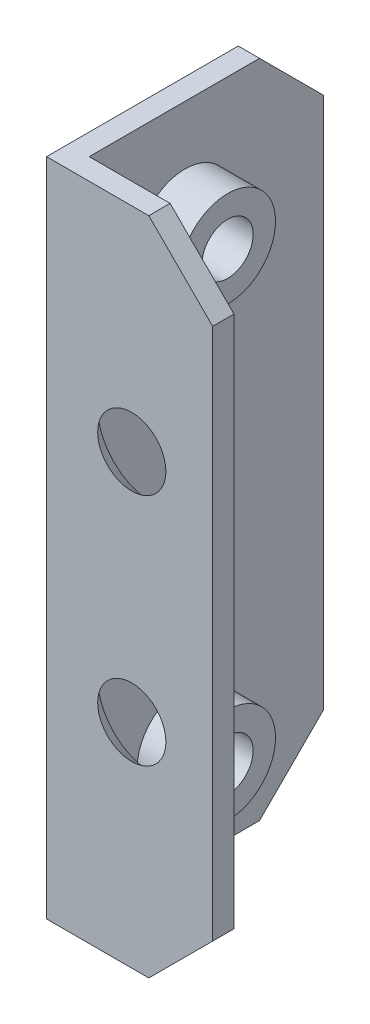
ISO-10303-21;
HEADER;
FILE_DESCRIPTION(('STEP AP214'),'2;1');
FILE_NAME('part.step','',(''),(''),'','','');
FILE_SCHEMA(('AUTOMOTIVE_DESIGN { 1 0 10303 214 1 1 1 1 }'));
ENDSEC;
DATA;
#1=APPLICATION_CONTEXT('core data for automotive mechanical design processes');
#2=APPLICATION_PROTOCOL_DEFINITION('international standard','automotive_design',2000,#1);
#3=PRODUCT_CONTEXT('',#1,'mechanical');
#4=PRODUCT('Part','Part','',(#3));
#5=PRODUCT_RELATED_PRODUCT_CATEGORY('part','',(#4));
#6=PRODUCT_DEFINITION_FORMATION('','',#4);
#7=PRODUCT_DEFINITION_CONTEXT('part definition',#1,'design');
#8=PRODUCT_DEFINITION('design','',#6,#7);
#9=PRODUCT_DEFINITION_SHAPE('','',#8);
#10=(LENGTH_UNIT() NAMED_UNIT(*) SI_UNIT(.MILLI.,.METRE.));
#11=(NAMED_UNIT(*) PLANE_ANGLE_UNIT() SI_UNIT($,.RADIAN.));
#12=(NAMED_UNIT(*) SI_UNIT($,.STERADIAN.) SOLID_ANGLE_UNIT());
#13=UNCERTAINTY_MEASURE_WITH_UNIT(LENGTH_MEASURE(1.E-05),#10,'distance_accuracy_value','');
#14=(GEOMETRIC_REPRESENTATION_CONTEXT(3) GLOBAL_UNCERTAINTY_ASSIGNED_CONTEXT((#13)) GLOBAL_UNIT_ASSIGNED_CONTEXT((#10,
#11,#12)) REPRESENTATION_CONTEXT('',''));
#15=CARTESIAN_POINT('',(0.,0.,0.));
#16=DIRECTION('',(0.,0.,1.));
#17=DIRECTION('',(1.,0.,0.));
#18=AXIS2_PLACEMENT_3D('',#15,#16,#17);
#19=CARTESIAN_POINT('',(1.,26.,-5.5));
#20=DIRECTION('',(1.,0.,0.));
#21=DIRECTION('',(0.,0.,-1.));
#22=AXIS2_PLACEMENT_3D('',#19,#20,#21);
#23=CYLINDRICAL_SURFACE('',#22,2.25);
#24=CARTESIAN_POINT('',(3.,26.,-5.5));
#25=DIRECTION('',(1.,0.,0.));
#26=DIRECTION('',(0.,0.,-1.));
#27=AXIS2_PLACEMENT_3D('',#24,#25,#26);
#28=CIRCLE('',#27,2.25);
#29=CARTESIAN_POINT('',(3.,26.,-7.75));
#30=VERTEX_POINT('',#29);
#31=EDGE_CURVE('E144',#30,#30,#28,.T.);
#32=ORIENTED_EDGE('',*,*,#31,.F.);
#33=EDGE_LOOP('',(#32));
#34=FACE_BOUND('',#33,.T.);
#35=CARTESIAN_POINT('',(1.,26.,-5.5));
#36=DIRECTION('',(1.,0.,0.));
#37=DIRECTION('',(0.,0.,-1.));
#38=AXIS2_PLACEMENT_3D('',#35,#36,#37);
#39=CIRCLE('',#38,2.25);
#40=CARTESIAN_POINT('',(1.,26.,-7.75));
#41=VERTEX_POINT('',#40);
#42=EDGE_CURVE('E150',#41,#41,#39,.F.);
#43=ORIENTED_EDGE('',*,*,#42,.F.);
#44=EDGE_LOOP('',(#43));
#45=FACE_BOUND('',#44,.T.);
#46=ADVANCED_FACE('F16',(#34,#45),#23,.T.);
#47=CARTESIAN_POINT('',(1.,5.,-5.5));
#48=DIRECTION('',(1.,0.,0.));
#49=DIRECTION('',(0.,0.,-1.));
#50=AXIS2_PLACEMENT_3D('',#47,#48,#49);
#51=CYLINDRICAL_SURFACE('',#50,2.25);
#52=CARTESIAN_POINT('',(3.,5.,-5.5));
#53=DIRECTION('',(1.,0.,0.));
#54=DIRECTION('',(0.,0.,-1.));
#55=AXIS2_PLACEMENT_3D('',#52,#53,#54);
#56=CIRCLE('',#55,2.25);
#57=CARTESIAN_POINT('',(3.,5.,-7.75));
#58=VERTEX_POINT('',#57);
#59=EDGE_CURVE('E140',#58,#58,#56,.T.);
#60=ORIENTED_EDGE('',*,*,#59,.F.);
#61=EDGE_LOOP('',(#60));
#62=FACE_BOUND('',#61,.T.);
#63=CARTESIAN_POINT('',(1.,5.,-5.5));
#64=DIRECTION('',(1.,0.,0.));
#65=DIRECTION('',(0.,0.,-1.));
#66=AXIS2_PLACEMENT_3D('',#63,#64,#65);
#67=CIRCLE('',#66,2.25);
#68=CARTESIAN_POINT('',(1.,5.,-7.75));
#69=VERTEX_POINT('',#68);
#70=EDGE_CURVE('E147',#69,#69,#67,.F.);
#71=ORIENTED_EDGE('',*,*,#70,.F.);
#72=EDGE_LOOP('',(#71));
#73=FACE_BOUND('',#72,.T.);
#74=ADVANCED_FACE('F275',(#62,#73),#51,.T.);
#75=CARTESIAN_POINT('',(6.3,1.5,-0.5));
#76=DIRECTION('',(0.707106781186548,-0.707106781186548,0.));
#77=DIRECTION('',(0.707106781186548,0.707106781186548,0.));
#78=AXIS2_PLACEMENT_3D('',#75,#76,#77);
#79=PLANE('',#78);
#80=DIRECTION('',(0.,0.,-1.));
#81=VECTOR('',#80,1.);
#82=CARTESIAN_POINT('',(7.8,3.,0.));
#83=LINE('',#82,#81);
#84=CARTESIAN_POINT('',(7.8,3.,0.));
#85=VERTEX_POINT('',#84);
#86=CARTESIAN_POINT('',(7.8,3.,-1.));
#87=VERTEX_POINT('',#86);
#88=EDGE_CURVE('E93',#85,#87,#83,.T.);
#89=ORIENTED_EDGE('',*,*,#88,.F.);
#90=DIRECTION('',(0.707106781186548,0.707106781186548,0.));
#91=VECTOR('',#90,1.);
#92=CARTESIAN_POINT('',(4.8,0.,0.));
#93=LINE('',#92,#91);
#94=CARTESIAN_POINT('',(4.8,0.,0.));
#95=VERTEX_POINT('',#94);
#96=EDGE_CURVE('E180',#95,#85,#93,.T.);
#97=ORIENTED_EDGE('',*,*,#96,.F.);
#98=DIRECTION('',(0.,0.,1.));
#99=VECTOR('',#98,1.);
#100=CARTESIAN_POINT('',(4.8,0.,0.));
#101=LINE('',#100,#99);
#102=CARTESIAN_POINT('',(4.8,0.,-1.));
#103=VERTEX_POINT('',#102);
#104=EDGE_CURVE('E106',#95,#103,#101,.F.);
#105=ORIENTED_EDGE('',*,*,#104,.T.);
#106=DIRECTION('',(-0.707106781186548,-0.707106781186548,0.));
#107=VECTOR('',#106,1.);
#108=CARTESIAN_POINT('',(7.8,3.,-1.));
#109=LINE('',#108,#107);
#110=EDGE_CURVE('E104',#87,#103,#109,.T.);
#111=ORIENTED_EDGE('',*,*,#110,.F.);
#112=EDGE_LOOP('',(#89,#97,#105,#111));
#113=FACE_BOUND('',#112,.T.);
#114=ADVANCED_FACE('F105',(#113),#79,.T.);
#115=CARTESIAN_POINT('',(7.8,0.,0.));
#116=DIRECTION('',(1.,0.,0.));
#117=DIRECTION('',(0.,0.,-1.));
#118=AXIS2_PLACEMENT_3D('',#115,#116,#117);
#119=PLANE('',#118);
#120=DIRECTION('',(0.,1.,0.));
#121=VECTOR('',#120,1.);
#122=CARTESIAN_POINT('',(7.8,0.,-1.));
#123=LINE('',#122,#121);
#124=CARTESIAN_POINT('',(7.8,28.,-1.));
#125=VERTEX_POINT('',#124);
#126=EDGE_CURVE('E90',#125,#87,#123,.F.);
#127=ORIENTED_EDGE('',*,*,#126,.F.);
#128=DIRECTION('',(0.,0.,1.));
#129=VECTOR('',#128,1.);
#130=CARTESIAN_POINT('',(7.8,28.,-0.5));
#131=LINE('',#130,#129);
#132=CARTESIAN_POINT('',(7.8,28.,0.));
#133=VERTEX_POINT('',#132);
#134=EDGE_CURVE('E115',#133,#125,#131,.F.);
#135=ORIENTED_EDGE('',*,*,#134,.F.);
#136=DIRECTION('',(0.,1.,0.));
#137=VECTOR('',#136,1.);
#138=CARTESIAN_POINT('',(7.8,0.,0.));
#139=LINE('',#138,#137);
#140=EDGE_CURVE('E97',#85,#133,#139,.T.);
#141=ORIENTED_EDGE('',*,*,#140,.F.);
#142=ORIENTED_EDGE('',*,*,#88,.T.);
#143=EDGE_LOOP('',(#127,#135,#141,#142));
#144=FACE_BOUND('',#143,.T.);
#145=ADVANCED_FACE('F95',(#144),#119,.T.);
#146=CARTESIAN_POINT('',(6.3,29.5,-0.5));
#147=DIRECTION('',(0.707106781186548,0.707106781186548,0.));
#148=DIRECTION('',(-0.707106781186548,0.707106781186548,0.));
#149=AXIS2_PLACEMENT_3D('',#146,#147,#148);
#150=PLANE('',#149);
#151=ORIENTED_EDGE('',*,*,#134,.T.);
#152=DIRECTION('',(0.707106781186548,-0.707106781186547,0.));
#153=VECTOR('',#152,1.);
#154=CARTESIAN_POINT('',(4.8,31.,-1.));
#155=LINE('',#154,#153);
#156=CARTESIAN_POINT('',(4.8,31.,-1.));
#157=VERTEX_POINT('',#156);
#158=EDGE_CURVE('E109',#157,#125,#155,.T.);
#159=ORIENTED_EDGE('',*,*,#158,.F.);
#160=DIRECTION('',(0.,0.,1.));
#161=VECTOR('',#160,1.);
#162=CARTESIAN_POINT('',(4.8,31.,-0.5));
#163=LINE('',#162,#161);
#164=CARTESIAN_POINT('',(4.8,31.,0.));
#165=VERTEX_POINT('',#164);
#166=EDGE_CURVE('E101',#157,#165,#163,.T.);
#167=ORIENTED_EDGE('',*,*,#166,.T.);
#168=DIRECTION('',(-0.707106781186548,0.707106781186547,0.));
#169=VECTOR('',#168,1.);
#170=CARTESIAN_POINT('',(7.8,28.,0.));
#171=LINE('',#170,#169);
#172=EDGE_CURVE('E139',#133,#165,#171,.T.);
#173=ORIENTED_EDGE('',*,*,#172,.F.);
#174=EDGE_LOOP('',(#151,#159,#167,#173));
#175=FACE_BOUND('',#174,.T.);
#176=ADVANCED_FACE('F284',(#175),#150,.T.);
#177=CARTESIAN_POINT('',(4.,10.,-1.00000145869217));
#178=DIRECTION('',(0.,0.,-1.));
#179=DIRECTION('',(-1.,0.,0.));
#180=AXIS2_PLACEMENT_3D('',#177,#178,#179);
#181=CONICAL_SURFACE('',#180,2.59999237824559,0.785396417167119);
#182=CARTESIAN_POINT('',(4.,10.,0.));
#183=DIRECTION('',(0.,0.,-1.));
#184=DIRECTION('',(-1.,0.,0.));
#185=AXIS2_PLACEMENT_3D('',#182,#183,#184);
#186=CIRCLE('',#185,1.59999441201308);
#187=CARTESIAN_POINT('',(2.40000558798693,10.,0.));
#188=VERTEX_POINT('',#187);
#189=EDGE_CURVE('E136',#188,#188,#186,.T.);
#190=ORIENTED_EDGE('',*,*,#189,.F.);
#191=EDGE_LOOP('',(#190));
#192=FACE_BOUND('',#191,.T.);
#193=CARTESIAN_POINT('',(4.,10.,-1.));
#194=DIRECTION('',(0.,0.,-1.));
#195=DIRECTION('',(-1.,0.,0.));
#196=AXIS2_PLACEMENT_3D('',#193,#194,#195);
#197=CIRCLE('',#196,2.59999091955851);
#198=CARTESIAN_POINT('',(1.40000908044149,10.,-1.));
#199=VERTEX_POINT('',#198);
#200=EDGE_CURVE('E19',#199,#199,#197,.F.);
#201=ORIENTED_EDGE('',*,*,#200,.F.);
#202=EDGE_LOOP('',(#201));
#203=FACE_BOUND('',#202,.T.);
#204=ADVANCED_FACE('F286',(#192,#203),#181,.F.);
#205=CARTESIAN_POINT('',(4.,21.,-1.00000145869217));
#206=DIRECTION('',(0.,0.,-1.));
#207=DIRECTION('',(-1.,0.,0.));
#208=AXIS2_PLACEMENT_3D('',#205,#206,#207);
#209=CONICAL_SURFACE('',#208,2.59999237827833,0.785396417167119);
#210=CARTESIAN_POINT('',(4.,21.,0.));
#211=DIRECTION('',(0.,0.,-1.));
#212=DIRECTION('',(-1.,0.,0.));
#213=AXIS2_PLACEMENT_3D('',#210,#211,#212);
#214=CIRCLE('',#213,1.59999441204582);
#215=CARTESIAN_POINT('',(2.40000558795418,21.,0.));
#216=VERTEX_POINT('',#215);
#217=EDGE_CURVE('E132',#216,#216,#214,.T.);
#218=ORIENTED_EDGE('',*,*,#217,.F.);
#219=EDGE_LOOP('',(#218));
#220=FACE_BOUND('',#219,.T.);
#221=CARTESIAN_POINT('',(4.,21.,-1.));
#222=DIRECTION('',(0.,0.,-1.));
#223=DIRECTION('',(-1.,0.,0.));
#224=AXIS2_PLACEMENT_3D('',#221,#222,#223);
#225=CIRCLE('',#224,2.59999091959126);
#226=CARTESIAN_POINT('',(1.40000908040874,21.,-1.));
#227=VERTEX_POINT('',#226);
#228=EDGE_CURVE('E153',#227,#227,#225,.F.);
#229=ORIENTED_EDGE('',*,*,#228,.F.);
#230=EDGE_LOOP('',(#229));
#231=FACE_BOUND('',#230,.T.);
#232=ADVANCED_FACE('F292',(#220,#231),#209,.F.);
#233=CARTESIAN_POINT('',(7.8,0.,-1.));
#234=DIRECTION('',(0.,0.,-1.));
#235=DIRECTION('',(-1.,0.,0.));
#236=AXIS2_PLACEMENT_3D('',#233,#234,#235);
#237=PLANE('',#236);
#238=ORIENTED_EDGE('',*,*,#228,.T.);
#239=EDGE_LOOP('',(#238));
#240=FACE_BOUND('',#239,.T.);
#241=ORIENTED_EDGE('',*,*,#200,.T.);
#242=EDGE_LOOP('',(#241));
#243=FACE_BOUND('',#242,.T.);
#244=DIRECTION('',(1.,0.,0.));
#245=VECTOR('',#244,1.);
#246=CARTESIAN_POINT('',(0.,31.,-1.));
#247=LINE('',#246,#245);
#248=CARTESIAN_POINT('',(1.,31.,-1.));
#249=VERTEX_POINT('',#248);
#250=EDGE_CURVE('E135',#157,#249,#247,.F.);
#251=ORIENTED_EDGE('',*,*,#250,.F.);
#252=ORIENTED_EDGE('',*,*,#158,.T.);
#253=ORIENTED_EDGE('',*,*,#126,.T.);
#254=ORIENTED_EDGE('',*,*,#110,.T.);
#255=DIRECTION('',(1.,0.,0.));
#256=VECTOR('',#255,1.);
#257=CARTESIAN_POINT('',(0.,0.,-1.));
#258=LINE('',#257,#256);
#259=CARTESIAN_POINT('',(1.,0.,-1.));
#260=VERTEX_POINT('',#259);
#261=EDGE_CURVE('E171',#103,#260,#258,.F.);
#262=ORIENTED_EDGE('',*,*,#261,.T.);
#263=DIRECTION('',(0.,1.,0.));
#264=VECTOR('',#263,1.);
#265=CARTESIAN_POINT('',(1.,0.,-1.));
#266=LINE('',#265,#264);
#267=EDGE_CURVE('E152',#249,#260,#266,.F.);
#268=ORIENTED_EDGE('',*,*,#267,.F.);
#269=EDGE_LOOP('',(#251,#252,#253,#254,#262,#268));
#270=FACE_BOUND('',#269,.T.);
#271=ADVANCED_FACE('F113',(#240,#243,#270),#237,.T.);
#272=CARTESIAN_POINT('',(1.,0.,-1.));
#273=DIRECTION('',(1.,0.,0.));
#274=DIRECTION('',(0.,0.,-1.));
#275=AXIS2_PLACEMENT_3D('',#272,#273,#274);
#276=PLANE('',#275);
#277=ORIENTED_EDGE('',*,*,#70,.T.);
#278=EDGE_LOOP('',(#277));
#279=FACE_BOUND('',#278,.T.);
#280=ORIENTED_EDGE('',*,*,#42,.T.);
#281=EDGE_LOOP('',(#280));
#282=FACE_BOUND('',#281,.T.);
#283=DIRECTION('',(0.,1.,0.));
#284=VECTOR('',#283,1.);
#285=CARTESIAN_POINT('',(1.,0.,-12.));
#286=LINE('',#285,#284);
#287=CARTESIAN_POINT('',(1.,28.,-12.));
#288=VERTEX_POINT('',#287);
#289=CARTESIAN_POINT('',(1.,3.,-12.));
#290=VERTEX_POINT('',#289);
#291=EDGE_CURVE('E143',#288,#290,#286,.F.);
#292=ORIENTED_EDGE('',*,*,#291,.F.);
#293=DIRECTION('',(0.,0.707106781186548,0.707106781186548));
#294=VECTOR('',#293,1.);
#295=CARTESIAN_POINT('',(1.,29.5,-10.5));
#296=LINE('',#295,#294);
#297=CARTESIAN_POINT('',(1.,31.,-9.));
#298=VERTEX_POINT('',#297);
#299=EDGE_CURVE('E193',#298,#288,#296,.F.);
#300=ORIENTED_EDGE('',*,*,#299,.F.);
#301=DIRECTION('',(0.,0.,1.));
#302=VECTOR('',#301,1.);
#303=CARTESIAN_POINT('',(1.,31.,0.));
#304=LINE('',#303,#302);
#305=EDGE_CURVE('E187',#249,#298,#304,.F.);
#306=ORIENTED_EDGE('',*,*,#305,.F.);
#307=ORIENTED_EDGE('',*,*,#267,.T.);
#308=DIRECTION('',(0.,0.,1.));
#309=VECTOR('',#308,1.);
#310=CARTESIAN_POINT('',(1.,0.,0.));
#311=LINE('',#310,#309);
#312=CARTESIAN_POINT('',(1.,0.,-9.));
#313=VERTEX_POINT('',#312);
#314=EDGE_CURVE('E173',#260,#313,#311,.F.);
#315=ORIENTED_EDGE('',*,*,#314,.T.);
#316=DIRECTION('',(0.,0.707106781186548,-0.707106781186548));
#317=VECTOR('',#316,1.);
#318=CARTESIAN_POINT('',(1.,1.5,-10.5));
#319=LINE('',#318,#317);
#320=EDGE_CURVE('E167',#290,#313,#319,.F.);
#321=ORIENTED_EDGE('',*,*,#320,.F.);
#322=EDGE_LOOP('',(#292,#300,#306,#307,#315,#321));
#323=FACE_BOUND('',#322,.T.);
#324=ADVANCED_FACE('F269',(#279,#282,#323),#276,.T.);
#325=CARTESIAN_POINT('',(3.,0.,0.));
#326=DIRECTION('',(1.,0.,0.));
#327=DIRECTION('',(0.,0.,-1.));
#328=AXIS2_PLACEMENT_3D('',#325,#326,#327);
#329=PLANE('',#328);
#330=CARTESIAN_POINT('',(3.,26.,-5.5));
#331=DIRECTION('',(1.,0.,0.));
#332=DIRECTION('',(0.,0.,-1.));
#333=AXIS2_PLACEMENT_3D('',#330,#331,#332);
#334=CIRCLE('',#333,1.2);
#335=CARTESIAN_POINT('',(3.,26.,-6.7));
#336=VERTEX_POINT('',#335);
#337=EDGE_CURVE('E128',#336,#336,#334,.F.);
#338=ORIENTED_EDGE('',*,*,#337,.T.);
#339=EDGE_LOOP('',(#338));
#340=FACE_BOUND('',#339,.T.);
#341=ORIENTED_EDGE('',*,*,#31,.T.);
#342=EDGE_LOOP('',(#341));
#343=FACE_BOUND('',#342,.T.);
#344=ADVANCED_FACE('F265',(#340,#343),#329,.T.);
#345=CARTESIAN_POINT('',(3.,0.,0.));
#346=DIRECTION('',(1.,0.,0.));
#347=DIRECTION('',(0.,0.,-1.));
#348=AXIS2_PLACEMENT_3D('',#345,#346,#347);
#349=PLANE('',#348);
#350=CARTESIAN_POINT('',(3.,5.,-5.5));
#351=DIRECTION('',(1.,0.,0.));
#352=DIRECTION('',(0.,0.,-1.));
#353=AXIS2_PLACEMENT_3D('',#350,#351,#352);
#354=CIRCLE('',#353,1.2);
#355=CARTESIAN_POINT('',(3.,5.,-6.7));
#356=VERTEX_POINT('',#355);
#357=EDGE_CURVE('E124',#356,#356,#354,.F.);
#358=ORIENTED_EDGE('',*,*,#357,.T.);
#359=EDGE_LOOP('',(#358));
#360=FACE_BOUND('',#359,.T.);
#361=ORIENTED_EDGE('',*,*,#59,.T.);
#362=EDGE_LOOP('',(#361));
#363=FACE_BOUND('',#362,.T.);
#364=ADVANCED_FACE('F268',(#360,#363),#349,.T.);
#365=CARTESIAN_POINT('',(1.,0.,-12.));
#366=DIRECTION('',(0.,0.,-1.));
#367=DIRECTION('',(-1.,0.,0.));
#368=AXIS2_PLACEMENT_3D('',#365,#366,#367);
#369=PLANE('',#368);
#370=DIRECTION('',(0.,1.,0.));
#371=VECTOR('',#370,1.);
#372=CARTESIAN_POINT('',(0.,0.,-12.));
#373=LINE('',#372,#371);
#374=CARTESIAN_POINT('',(0.,28.,-12.));
#375=VERTEX_POINT('',#374);
#376=CARTESIAN_POINT('',(0.,3.,-12.));
#377=VERTEX_POINT('',#376);
#378=EDGE_CURVE('E127',#375,#377,#373,.F.);
#379=ORIENTED_EDGE('',*,*,#378,.F.);
#380=DIRECTION('',(1.,0.,0.));
#381=VECTOR('',#380,1.);
#382=CARTESIAN_POINT('',(0.5,28.,-12.));
#383=LINE('',#382,#381);
#384=EDGE_CURVE('E131',#288,#375,#383,.F.);
#385=ORIENTED_EDGE('',*,*,#384,.F.);
#386=ORIENTED_EDGE('',*,*,#291,.T.);
#387=DIRECTION('',(1.,0.,0.));
#388=VECTOR('',#387,1.);
#389=CARTESIAN_POINT('',(0.5,3.,-12.));
#390=LINE('',#389,#388);
#391=EDGE_CURVE('E164',#377,#290,#390,.T.);
#392=ORIENTED_EDGE('',*,*,#391,.F.);
#393=EDGE_LOOP('',(#379,#385,#386,#392));
#394=FACE_BOUND('',#393,.T.);
#395=ADVANCED_FACE('F220',(#394),#369,.T.);
#396=CARTESIAN_POINT('',(0.5,1.5,-10.5));
#397=DIRECTION('',(0.,-0.707106781186548,-0.707106781186548));
#398=DIRECTION('',(0.,0.707106781186548,-0.707106781186548));
#399=AXIS2_PLACEMENT_3D('',#396,#397,#398);
#400=PLANE('',#399);
#401=ORIENTED_EDGE('',*,*,#391,.T.);
#402=ORIENTED_EDGE('',*,*,#320,.T.);
#403=DIRECTION('',(1.,0.,0.));
#404=VECTOR('',#403,1.);
#405=CARTESIAN_POINT('',(0.,0.,-9.));
#406=LINE('',#405,#404);
#407=CARTESIAN_POINT('',(0.,0.,-9.));
#408=VERTEX_POINT('',#407);
#409=EDGE_CURVE('E175',#313,#408,#406,.F.);
#410=ORIENTED_EDGE('',*,*,#409,.T.);
#411=DIRECTION('',(0.,-0.707106781186548,0.707106781186547));
#412=VECTOR('',#411,1.);
#413=CARTESIAN_POINT('',(0.,3.,-12.));
#414=LINE('',#413,#412);
#415=EDGE_CURVE('E200',#377,#408,#414,.T.);
#416=ORIENTED_EDGE('',*,*,#415,.F.);
#417=EDGE_LOOP('',(#401,#402,#410,#416));
#418=FACE_BOUND('',#417,.T.);
#419=ADVANCED_FACE('F224',(#418),#400,.T.);
#420=CARTESIAN_POINT('',(0.,0.,0.));
#421=DIRECTION('',(0.,1.,0.));
#422=DIRECTION('',(0.,0.,1.));
#423=AXIS2_PLACEMENT_3D('',#420,#421,#422);
#424=PLANE('',#423);
#425=DIRECTION('',(0.,0.,1.));
#426=VECTOR('',#425,1.);
#427=CARTESIAN_POINT('',(0.,0.,-12.));
#428=LINE('',#427,#426);
#429=CARTESIAN_POINT('',(0.,0.,0.));
#430=VERTEX_POINT('',#429);
#431=EDGE_CURVE('E203',#408,#430,#428,.T.);
#432=ORIENTED_EDGE('',*,*,#431,.F.);
#433=ORIENTED_EDGE('',*,*,#409,.F.);
#434=ORIENTED_EDGE('',*,*,#314,.F.);
#435=ORIENTED_EDGE('',*,*,#261,.F.);
#436=ORIENTED_EDGE('',*,*,#104,.F.);
#437=DIRECTION('',(1.,0.,0.));
#438=VECTOR('',#437,1.);
#439=CARTESIAN_POINT('',(0.,0.,0.));
#440=LINE('',#439,#438);
#441=EDGE_CURVE('E177',#430,#95,#440,.T.);
#442=ORIENTED_EDGE('',*,*,#441,.F.);
#443=EDGE_LOOP('',(#432,#433,#434,#435,#436,#442));
#444=FACE_BOUND('',#443,.T.);
#445=ADVANCED_FACE('F229',(#444),#424,.F.);
#446=CARTESIAN_POINT('',(0.,0.,0.));
#447=DIRECTION('',(0.,0.,1.));
#448=DIRECTION('',(1.,0.,0.));
#449=AXIS2_PLACEMENT_3D('',#446,#447,#448);
#450=PLANE('',#449);
#451=ORIENTED_EDGE('',*,*,#217,.T.);
#452=EDGE_LOOP('',(#451));
#453=FACE_BOUND('',#452,.T.);
#454=ORIENTED_EDGE('',*,*,#189,.T.);
#455=EDGE_LOOP('',(#454));
#456=FACE_BOUND('',#455,.T.);
#457=ORIENTED_EDGE('',*,*,#140,.T.);
#458=ORIENTED_EDGE('',*,*,#172,.T.);
#459=DIRECTION('',(1.,0.,0.));
#460=VECTOR('',#459,1.);
#461=CARTESIAN_POINT('',(0.,31.,0.));
#462=LINE('',#461,#460);
#463=CARTESIAN_POINT('',(0.,31.,0.));
#464=VERTEX_POINT('',#463);
#465=EDGE_CURVE('E189',#464,#165,#462,.T.);
#466=ORIENTED_EDGE('',*,*,#465,.F.);
#467=DIRECTION('',(0.,1.,0.));
#468=VECTOR('',#467,1.);
#469=CARTESIAN_POINT('',(0.,0.,0.));
#470=LINE('',#469,#468);
#471=EDGE_CURVE('E206',#430,#464,#470,.T.);
#472=ORIENTED_EDGE('',*,*,#471,.F.);
#473=ORIENTED_EDGE('',*,*,#441,.T.);
#474=ORIENTED_EDGE('',*,*,#96,.T.);
#475=EDGE_LOOP('',(#457,#458,#466,#472,#473,#474));
#476=FACE_BOUND('',#475,.T.);
#477=ADVANCED_FACE('F232',(#453,#456,#476),#450,.T.);
#478=CARTESIAN_POINT('',(0.,31.,0.));
#479=DIRECTION('',(0.,1.,0.));
#480=DIRECTION('',(0.,0.,1.));
#481=AXIS2_PLACEMENT_3D('',#478,#479,#480);
#482=PLANE('',#481);
#483=ORIENTED_EDGE('',*,*,#465,.T.);
#484=ORIENTED_EDGE('',*,*,#166,.F.);
#485=ORIENTED_EDGE('',*,*,#250,.T.);
#486=ORIENTED_EDGE('',*,*,#305,.T.);
#487=DIRECTION('',(1.,0.,0.));
#488=VECTOR('',#487,1.);
#489=CARTESIAN_POINT('',(0.5,31.,-9.));
#490=LINE('',#489,#488);
#491=CARTESIAN_POINT('',(0.,31.,-9.));
#492=VERTEX_POINT('',#491);
#493=EDGE_CURVE('E34',#492,#298,#490,.T.);
#494=ORIENTED_EDGE('',*,*,#493,.F.);
#495=DIRECTION('',(0.,0.,1.));
#496=VECTOR('',#495,1.);
#497=CARTESIAN_POINT('',(0.,31.,-12.));
#498=LINE('',#497,#496);
#499=EDGE_CURVE('E209',#464,#492,#498,.F.);
#500=ORIENTED_EDGE('',*,*,#499,.F.);
#501=EDGE_LOOP('',(#483,#484,#485,#486,#494,#500));
#502=FACE_BOUND('',#501,.T.);
#503=ADVANCED_FACE('F234',(#502),#482,.T.);
#504=CARTESIAN_POINT('',(0.5,29.5,-10.5));
#505=DIRECTION('',(0.,0.707106781186548,-0.707106781186548));
#506=DIRECTION('',(0.,0.707106781186548,0.707106781186548));
#507=AXIS2_PLACEMENT_3D('',#504,#505,#506);
#508=PLANE('',#507);
#509=ORIENTED_EDGE('',*,*,#384,.T.);
#510=DIRECTION('',(0.,-0.707106781186548,-0.707106781186548));
#511=VECTOR('',#510,1.);
#512=CARTESIAN_POINT('',(0.,31.,-9.));
#513=LINE('',#512,#511);
#514=EDGE_CURVE('E123',#492,#375,#513,.T.);
#515=ORIENTED_EDGE('',*,*,#514,.F.);
#516=ORIENTED_EDGE('',*,*,#493,.T.);
#517=ORIENTED_EDGE('',*,*,#299,.T.);
#518=EDGE_LOOP('',(#509,#515,#516,#517));
#519=FACE_BOUND('',#518,.T.);
#520=ADVANCED_FACE('F216',(#519),#508,.T.);
#521=CARTESIAN_POINT('',(1.,26.,-5.5));
#522=DIRECTION('',(1.,0.,0.));
#523=DIRECTION('',(0.,0.,-1.));
#524=AXIS2_PLACEMENT_3D('',#521,#522,#523);
#525=CYLINDRICAL_SURFACE('',#524,1.2);
#526=ORIENTED_EDGE('',*,*,#337,.F.);
#527=EDGE_LOOP('',(#526));
#528=FACE_BOUND('',#527,.T.);
#529=CARTESIAN_POINT('',(0.,26.,-5.5));
#530=DIRECTION('',(1.,0.,0.));
#531=DIRECTION('',(0.,0.,-1.));
#532=AXIS2_PLACEMENT_3D('',#529,#530,#531);
#533=CIRCLE('',#532,1.2);
#534=CARTESIAN_POINT('',(0.,26.,-6.7));
#535=VERTEX_POINT('',#534);
#536=EDGE_CURVE('E25',#535,#535,#533,.T.);
#537=ORIENTED_EDGE('',*,*,#536,.F.);
#538=EDGE_LOOP('',(#537));
#539=FACE_BOUND('',#538,.T.);
#540=ADVANCED_FACE('F242',(#528,#539),#525,.F.);
#541=CARTESIAN_POINT('',(1.,5.,-5.5));
#542=DIRECTION('',(1.,0.,0.));
#543=DIRECTION('',(0.,0.,-1.));
#544=AXIS2_PLACEMENT_3D('',#541,#542,#543);
#545=CYLINDRICAL_SURFACE('',#544,1.2);
#546=ORIENTED_EDGE('',*,*,#357,.F.);
#547=EDGE_LOOP('',(#546));
#548=FACE_BOUND('',#547,.T.);
#549=CARTESIAN_POINT('',(0.,5.,-5.5));
#550=DIRECTION('',(1.,0.,0.));
#551=DIRECTION('',(0.,0.,-1.));
#552=AXIS2_PLACEMENT_3D('',#549,#550,#551);
#553=CIRCLE('',#552,1.2);
#554=CARTESIAN_POINT('',(0.,5.,-6.7));
#555=VERTEX_POINT('',#554);
#556=EDGE_CURVE('E11',#555,#555,#553,.T.);
#557=ORIENTED_EDGE('',*,*,#556,.F.);
#558=EDGE_LOOP('',(#557));
#559=FACE_BOUND('',#558,.T.);
#560=ADVANCED_FACE('F247',(#548,#559),#545,.F.);
#561=CARTESIAN_POINT('',(0.,0.,-12.));
#562=DIRECTION('',(-1.,0.,0.));
#563=DIRECTION('',(0.,0.,1.));
#564=AXIS2_PLACEMENT_3D('',#561,#562,#563);
#565=PLANE('',#564);
#566=ORIENTED_EDGE('',*,*,#556,.T.);
#567=EDGE_LOOP('',(#566));
#568=FACE_BOUND('',#567,.T.);
#569=ORIENTED_EDGE('',*,*,#536,.T.);
#570=EDGE_LOOP('',(#569));
#571=FACE_BOUND('',#570,.T.);
#572=ORIENTED_EDGE('',*,*,#499,.T.);
#573=ORIENTED_EDGE('',*,*,#514,.T.);
#574=ORIENTED_EDGE('',*,*,#378,.T.);
#575=ORIENTED_EDGE('',*,*,#415,.T.);
#576=ORIENTED_EDGE('',*,*,#431,.T.);
#577=ORIENTED_EDGE('',*,*,#471,.T.);
#578=EDGE_LOOP('',(#572,#573,#574,#575,#576,#577));
#579=FACE_BOUND('',#578,.T.);
#580=ADVANCED_FACE('F214',(#568,#571,#579),#565,.T.);
#581=CLOSED_SHELL('',(#46,#74,#114,#145,#176,#204,#232,#271,#324,#344,#364,#395,#419,#445,#477,
#503,#520,#540,#560,#580));
#582=MANIFOLD_SOLID_BREP('B1',#581);
#583=ADVANCED_BREP_SHAPE_REPRESENTATION('',(#18,#582),#14);
#584=SHAPE_DEFINITION_REPRESENTATION(#9,#583);
ENDSEC;
END-ISO-10303-21;
